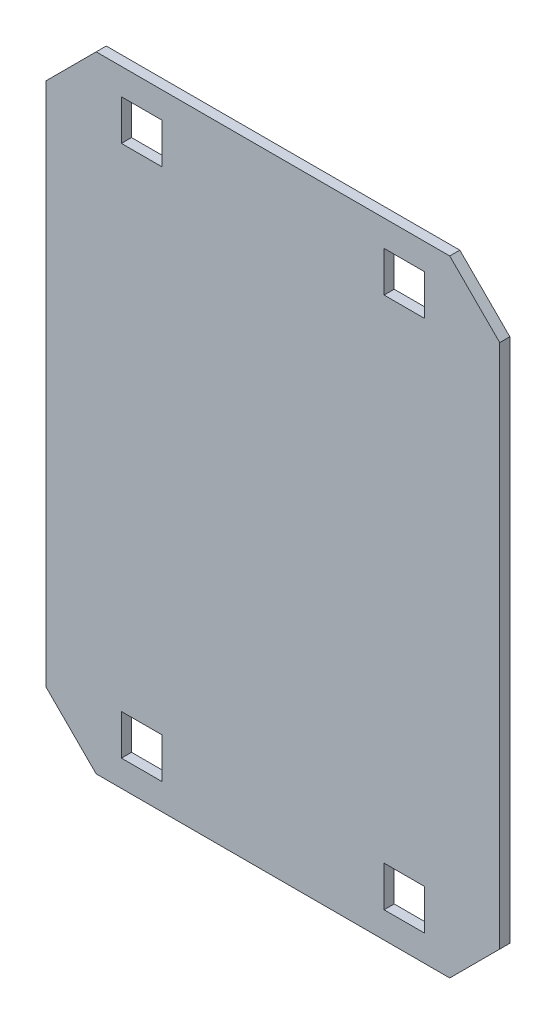
ISO-10303-21;
HEADER;
FILE_DESCRIPTION(('STEP AP214'),'2;1');
FILE_NAME('part.step','',(''),(''),'','','');
FILE_SCHEMA(('AUTOMOTIVE_DESIGN { 1 0 10303 214 1 1 1 1 }'));
ENDSEC;
DATA;
#1=APPLICATION_CONTEXT('core data for automotive mechanical design processes');
#2=APPLICATION_PROTOCOL_DEFINITION('international standard','automotive_design',2000,#1);
#3=PRODUCT_CONTEXT('',#1,'mechanical');
#4=PRODUCT('Part','Part','',(#3));
#5=PRODUCT_RELATED_PRODUCT_CATEGORY('part','',(#4));
#6=PRODUCT_DEFINITION_FORMATION('','',#4);
#7=PRODUCT_DEFINITION_CONTEXT('part definition',#1,'design');
#8=PRODUCT_DEFINITION('design','',#6,#7);
#9=PRODUCT_DEFINITION_SHAPE('','',#8);
#10=(LENGTH_UNIT() NAMED_UNIT(*) SI_UNIT(.MILLI.,.METRE.));
#11=(NAMED_UNIT(*) PLANE_ANGLE_UNIT() SI_UNIT($,.RADIAN.));
#12=(NAMED_UNIT(*) SI_UNIT($,.STERADIAN.) SOLID_ANGLE_UNIT());
#13=UNCERTAINTY_MEASURE_WITH_UNIT(LENGTH_MEASURE(1.E-05),#10,'distance_accuracy_value','');
#14=(GEOMETRIC_REPRESENTATION_CONTEXT(3) GLOBAL_UNCERTAINTY_ASSIGNED_CONTEXT((#13)) GLOBAL_UNIT_ASSIGNED_CONTEXT((#10,
#11,#12)) REPRESENTATION_CONTEXT('',''));
#15=CARTESIAN_POINT('',(0.,0.,0.));
#16=DIRECTION('',(0.,0.,1.));
#17=DIRECTION('',(1.,0.,0.));
#18=AXIS2_PLACEMENT_3D('',#15,#16,#17);
#19=CARTESIAN_POINT('',(-112.248737341529,130.,5.));
#20=DIRECTION('',(1.,0.,0.));
#21=DIRECTION('',(0.,1.,0.));
#22=AXIS2_PLACEMENT_3D('',#19,#20,#21);
#23=PLANE('',#22);
#24=DIRECTION('',(0.,-1.,0.));
#25=VECTOR('',#24,1.);
#26=CARTESIAN_POINT('',(-112.248737341529,130.,0.));
#27=LINE('',#26,#25);
#28=CARTESIAN_POINT('',(-112.248737341529,130.,0.));
#29=VERTEX_POINT('',#28);
#30=CARTESIAN_POINT('',(-112.248737341529,-130.,0.));
#31=VERTEX_POINT('',#30);
#32=EDGE_CURVE('E321',#29,#31,#27,.T.);
#33=ORIENTED_EDGE('',*,*,#32,.T.);
#34=DIRECTION('',(0.,0.,-1.));
#35=VECTOR('',#34,1.);
#36=CARTESIAN_POINT('',(-112.248737341529,-130.,5.));
#37=LINE('',#36,#35);
#38=CARTESIAN_POINT('',(-112.248737341529,-130.,5.));
#39=VERTEX_POINT('',#38);
#40=EDGE_CURVE('E11',#39,#31,#37,.T.);
#41=ORIENTED_EDGE('',*,*,#40,.F.);
#42=DIRECTION('',(0.,-1.,0.));
#43=VECTOR('',#42,1.);
#44=CARTESIAN_POINT('',(-112.248737341529,130.,5.));
#45=LINE('',#44,#43);
#46=CARTESIAN_POINT('',(-112.248737341529,130.,5.));
#47=VERTEX_POINT('',#46);
#48=EDGE_CURVE('E328',#47,#39,#45,.T.);
#49=ORIENTED_EDGE('',*,*,#48,.F.);
#50=DIRECTION('',(0.,0.,-1.));
#51=VECTOR('',#50,1.);
#52=CARTESIAN_POINT('',(-112.248737341529,130.,5.));
#53=LINE('',#52,#51);
#54=EDGE_CURVE('E346',#47,#29,#53,.T.);
#55=ORIENTED_EDGE('',*,*,#54,.T.);
#56=EDGE_LOOP('',(#33,#41,#49,#55));
#57=FACE_BOUND('',#56,.T.);
#58=ADVANCED_FACE('F32',(#57),#23,.F.);
#59=CARTESIAN_POINT('',(-112.248737341529,-130.,5.));
#60=DIRECTION('',(0.707106781186549,0.707106781186546,0.));
#61=DIRECTION('',(-0.707106781186546,0.707106781186549,0.));
#62=AXIS2_PLACEMENT_3D('',#59,#60,#61);
#63=PLANE('',#62);
#64=DIRECTION('',(0.707106781186546,-0.707106781186549,0.));
#65=VECTOR('',#64,1.);
#66=CARTESIAN_POINT('',(-112.248737341529,-130.,0.));
#67=LINE('',#66,#65);
#68=CARTESIAN_POINT('',(-87.5,-154.748737341529,0.));
#69=VERTEX_POINT('',#68);
#70=EDGE_CURVE('E349',#31,#69,#67,.T.);
#71=ORIENTED_EDGE('',*,*,#70,.T.);
#72=DIRECTION('',(0.,0.,-1.));
#73=VECTOR('',#72,1.);
#74=CARTESIAN_POINT('',(-87.5,-154.748737341529,5.));
#75=LINE('',#74,#73);
#76=CARTESIAN_POINT('',(-87.5,-154.748737341529,5.));
#77=VERTEX_POINT('',#76);
#78=EDGE_CURVE('E39',#77,#69,#75,.T.);
#79=ORIENTED_EDGE('',*,*,#78,.F.);
#80=DIRECTION('',(0.707106781186546,-0.707106781186549,0.));
#81=VECTOR('',#80,1.);
#82=CARTESIAN_POINT('',(-112.248737341529,-130.,5.));
#83=LINE('',#82,#81);
#84=EDGE_CURVE('E331',#39,#77,#83,.T.);
#85=ORIENTED_EDGE('',*,*,#84,.F.);
#86=ORIENTED_EDGE('',*,*,#40,.T.);
#87=EDGE_LOOP('',(#71,#79,#85,#86));
#88=FACE_BOUND('',#87,.T.);
#89=ADVANCED_FACE('F405',(#88),#63,.F.);
#90=CARTESIAN_POINT('',(87.5,-154.748737341529,5.));
#91=DIRECTION('',(0.,1.,0.));
#92=DIRECTION('',(-1.,0.,0.));
#93=AXIS2_PLACEMENT_3D('',#90,#91,#92);
#94=PLANE('',#93);
#95=DIRECTION('',(1.,0.,0.));
#96=VECTOR('',#95,1.);
#97=CARTESIAN_POINT('',(87.5,-154.748737341529,0.));
#98=LINE('',#97,#96);
#99=CARTESIAN_POINT('',(87.5,-154.748737341529,0.));
#100=VERTEX_POINT('',#99);
#101=EDGE_CURVE('E351',#69,#100,#98,.T.);
#102=ORIENTED_EDGE('',*,*,#101,.T.);
#103=DIRECTION('',(0.,0.,-1.));
#104=VECTOR('',#103,1.);
#105=CARTESIAN_POINT('',(87.5,-154.748737341529,5.));
#106=LINE('',#105,#104);
#107=CARTESIAN_POINT('',(87.5,-154.748737341529,5.));
#108=VERTEX_POINT('',#107);
#109=EDGE_CURVE('E376',#108,#100,#106,.T.);
#110=ORIENTED_EDGE('',*,*,#109,.F.);
#111=DIRECTION('',(1.,0.,0.));
#112=VECTOR('',#111,1.);
#113=CARTESIAN_POINT('',(87.5,-154.748737341529,5.));
#114=LINE('',#113,#112);
#115=EDGE_CURVE('E334',#77,#108,#114,.T.);
#116=ORIENTED_EDGE('',*,*,#115,.F.);
#117=ORIENTED_EDGE('',*,*,#78,.T.);
#118=EDGE_LOOP('',(#102,#110,#116,#117));
#119=FACE_BOUND('',#118,.T.);
#120=ADVANCED_FACE('F383',(#119),#94,.F.);
#121=CARTESIAN_POINT('',(112.248737341529,-130.,5.));
#122=DIRECTION('',(-0.707106781186549,0.707106781186546,0.));
#123=DIRECTION('',(-0.707106781186546,-0.707106781186549,0.));
#124=AXIS2_PLACEMENT_3D('',#121,#122,#123);
#125=PLANE('',#124);
#126=DIRECTION('',(0.707106781186546,0.707106781186549,0.));
#127=VECTOR('',#126,1.);
#128=CARTESIAN_POINT('',(112.248737341529,-130.,0.));
#129=LINE('',#128,#127);
#130=CARTESIAN_POINT('',(112.248737341529,-130.,0.));
#131=VERTEX_POINT('',#130);
#132=EDGE_CURVE('E353',#100,#131,#129,.T.);
#133=ORIENTED_EDGE('',*,*,#132,.T.);
#134=DIRECTION('',(0.,0.,-1.));
#135=VECTOR('',#134,1.);
#136=CARTESIAN_POINT('',(112.248737341529,-130.,5.));
#137=LINE('',#136,#135);
#138=CARTESIAN_POINT('',(112.248737341529,-130.,5.));
#139=VERTEX_POINT('',#138);
#140=EDGE_CURVE('E373',#139,#131,#137,.T.);
#141=ORIENTED_EDGE('',*,*,#140,.F.);
#142=DIRECTION('',(0.707106781186546,0.707106781186549,0.));
#143=VECTOR('',#142,1.);
#144=CARTESIAN_POINT('',(112.248737341529,-130.,5.));
#145=LINE('',#144,#143);
#146=EDGE_CURVE('E336',#108,#139,#145,.T.);
#147=ORIENTED_EDGE('',*,*,#146,.F.);
#148=ORIENTED_EDGE('',*,*,#109,.T.);
#149=EDGE_LOOP('',(#133,#141,#147,#148));
#150=FACE_BOUND('',#149,.T.);
#151=ADVANCED_FACE('F393',(#150),#125,.F.);
#152=CARTESIAN_POINT('',(112.248737341529,130.,5.));
#153=DIRECTION('',(-1.,0.,0.));
#154=DIRECTION('',(0.,0.,1.));
#155=AXIS2_PLACEMENT_3D('',#152,#153,#154);
#156=PLANE('',#155);
#157=DIRECTION('',(0.,1.,0.));
#158=VECTOR('',#157,1.);
#159=CARTESIAN_POINT('',(112.248737341529,130.,0.));
#160=LINE('',#159,#158);
#161=CARTESIAN_POINT('',(112.248737341529,130.,0.));
#162=VERTEX_POINT('',#161);
#163=EDGE_CURVE('E355',#131,#162,#160,.T.);
#164=ORIENTED_EDGE('',*,*,#163,.T.);
#165=DIRECTION('',(0.,0.,-1.));
#166=VECTOR('',#165,1.);
#167=CARTESIAN_POINT('',(112.248737341529,130.,5.));
#168=LINE('',#167,#166);
#169=CARTESIAN_POINT('',(112.248737341529,130.,5.));
#170=VERTEX_POINT('',#169);
#171=EDGE_CURVE('E370',#170,#162,#168,.T.);
#172=ORIENTED_EDGE('',*,*,#171,.F.);
#173=DIRECTION('',(0.,1.,0.));
#174=VECTOR('',#173,1.);
#175=CARTESIAN_POINT('',(112.248737341529,130.,5.));
#176=LINE('',#175,#174);
#177=EDGE_CURVE('E338',#139,#170,#176,.T.);
#178=ORIENTED_EDGE('',*,*,#177,.F.);
#179=ORIENTED_EDGE('',*,*,#140,.T.);
#180=EDGE_LOOP('',(#164,#172,#178,#179));
#181=FACE_BOUND('',#180,.T.);
#182=ADVANCED_FACE('F397',(#181),#156,.F.);
#183=CARTESIAN_POINT('',(112.248737341529,130.,5.));
#184=DIRECTION('',(-0.707106781186549,-0.707106781186546,0.));
#185=DIRECTION('',(0.707106781186546,-0.707106781186549,0.));
#186=AXIS2_PLACEMENT_3D('',#183,#184,#185);
#187=PLANE('',#186);
#188=DIRECTION('',(-0.707106781186546,0.707106781186549,0.));
#189=VECTOR('',#188,1.);
#190=CARTESIAN_POINT('',(112.248737341529,130.,0.));
#191=LINE('',#190,#189);
#192=CARTESIAN_POINT('',(87.5,154.748737341529,0.));
#193=VERTEX_POINT('',#192);
#194=EDGE_CURVE('E357',#162,#193,#191,.T.);
#195=ORIENTED_EDGE('',*,*,#194,.T.);
#196=DIRECTION('',(0.,0.,-1.));
#197=VECTOR('',#196,1.);
#198=CARTESIAN_POINT('',(87.5,154.748737341529,5.));
#199=LINE('',#198,#197);
#200=CARTESIAN_POINT('',(87.5,154.748737341529,5.));
#201=VERTEX_POINT('',#200);
#202=EDGE_CURVE('E367',#201,#193,#199,.T.);
#203=ORIENTED_EDGE('',*,*,#202,.F.);
#204=DIRECTION('',(-0.707106781186546,0.707106781186549,0.));
#205=VECTOR('',#204,1.);
#206=CARTESIAN_POINT('',(112.248737341529,130.,5.));
#207=LINE('',#206,#205);
#208=EDGE_CURVE('E340',#170,#201,#207,.T.);
#209=ORIENTED_EDGE('',*,*,#208,.F.);
#210=ORIENTED_EDGE('',*,*,#171,.T.);
#211=EDGE_LOOP('',(#195,#203,#209,#210));
#212=FACE_BOUND('',#211,.T.);
#213=ADVANCED_FACE('F418',(#212),#187,.F.);
#214=CARTESIAN_POINT('',(-87.5,154.748737341529,5.));
#215=DIRECTION('',(0.,-1.,0.));
#216=DIRECTION('',(1.,0.,0.));
#217=AXIS2_PLACEMENT_3D('',#214,#215,#216);
#218=PLANE('',#217);
#219=DIRECTION('',(-1.,0.,0.));
#220=VECTOR('',#219,1.);
#221=CARTESIAN_POINT('',(-87.5,154.748737341529,0.));
#222=LINE('',#221,#220);
#223=CARTESIAN_POINT('',(-87.5,154.748737341529,0.));
#224=VERTEX_POINT('',#223);
#225=EDGE_CURVE('E359',#193,#224,#222,.T.);
#226=ORIENTED_EDGE('',*,*,#225,.T.);
#227=DIRECTION('',(0.,0.,-1.));
#228=VECTOR('',#227,1.);
#229=CARTESIAN_POINT('',(-87.5,154.748737341529,5.));
#230=LINE('',#229,#228);
#231=CARTESIAN_POINT('',(-87.5,154.748737341529,5.));
#232=VERTEX_POINT('',#231);
#233=EDGE_CURVE('E364',#232,#224,#230,.T.);
#234=ORIENTED_EDGE('',*,*,#233,.F.);
#235=DIRECTION('',(-1.,0.,0.));
#236=VECTOR('',#235,1.);
#237=CARTESIAN_POINT('',(-87.5,154.748737341529,5.));
#238=LINE('',#237,#236);
#239=EDGE_CURVE('E342',#201,#232,#238,.T.);
#240=ORIENTED_EDGE('',*,*,#239,.F.);
#241=ORIENTED_EDGE('',*,*,#202,.T.);
#242=EDGE_LOOP('',(#226,#234,#240,#241));
#243=FACE_BOUND('',#242,.T.);
#244=ADVANCED_FACE('F416',(#243),#218,.F.);
#245=CARTESIAN_POINT('',(-112.248737341529,130.,5.));
#246=DIRECTION('',(0.707106781186549,-0.707106781186546,0.));
#247=DIRECTION('',(0.707106781186546,0.707106781186549,0.));
#248=AXIS2_PLACEMENT_3D('',#245,#246,#247);
#249=PLANE('',#248);
#250=DIRECTION('',(-0.707106781186546,-0.707106781186549,0.));
#251=VECTOR('',#250,1.);
#252=CARTESIAN_POINT('',(-112.248737341529,130.,0.));
#253=LINE('',#252,#251);
#254=EDGE_CURVE('E332',#224,#29,#253,.T.);
#255=ORIENTED_EDGE('',*,*,#254,.T.);
#256=ORIENTED_EDGE('',*,*,#54,.F.);
#257=DIRECTION('',(-0.707106781186546,-0.707106781186549,0.));
#258=VECTOR('',#257,1.);
#259=CARTESIAN_POINT('',(-112.248737341529,130.,5.));
#260=LINE('',#259,#258);
#261=EDGE_CURVE('E344',#232,#47,#260,.T.);
#262=ORIENTED_EDGE('',*,*,#261,.F.);
#263=ORIENTED_EDGE('',*,*,#233,.T.);
#264=EDGE_LOOP('',(#255,#256,#262,#263));
#265=FACE_BOUND('',#264,.T.);
#266=ADVANCED_FACE('F411',(#265),#249,.F.);
#267=CARTESIAN_POINT('',(0.,0.,5.));
#268=DIRECTION('',(0.,0.,-1.));
#269=DIRECTION('',(-1.,0.,0.));
#270=AXIS2_PLACEMENT_3D('',#267,#268,#269);
#271=PLANE('',#270);
#272=DIRECTION('',(-1.,0.,0.));
#273=VECTOR('',#272,1.);
#274=CARTESIAN_POINT('',(75.0000000000001,141.748737341529,5.));
#275=LINE('',#274,#273);
#276=CARTESIAN_POINT('',(75.0000000000001,141.748737341529,5.));
#277=VERTEX_POINT('',#276);
#278=CARTESIAN_POINT('',(55.0000000000001,141.748737341529,5.));
#279=VERTEX_POINT('',#278);
#280=EDGE_CURVE('E282',#277,#279,#275,.T.);
#281=ORIENTED_EDGE('',*,*,#280,.F.);
#282=DIRECTION('',(0.,1.,0.));
#283=VECTOR('',#282,1.);
#284=CARTESIAN_POINT('',(75.0000000000001,141.748737341529,5.));
#285=LINE('',#284,#283);
#286=CARTESIAN_POINT('',(75.0000000000001,121.748737341529,5.));
#287=VERTEX_POINT('',#286);
#288=EDGE_CURVE('E46',#287,#277,#285,.T.);
#289=ORIENTED_EDGE('',*,*,#288,.F.);
#290=DIRECTION('',(1.,0.,0.));
#291=VECTOR('',#290,1.);
#292=CARTESIAN_POINT('',(75.0000000000001,121.748737341529,5.));
#293=LINE('',#292,#291);
#294=CARTESIAN_POINT('',(55.0000000000001,121.748737341529,5.));
#295=VERTEX_POINT('',#294);
#296=EDGE_CURVE('E271',#295,#287,#293,.T.);
#297=ORIENTED_EDGE('',*,*,#296,.F.);
#298=DIRECTION('',(0.,-1.,0.));
#299=VECTOR('',#298,1.);
#300=CARTESIAN_POINT('',(55.0000000000001,141.748737341529,5.));
#301=LINE('',#300,#299);
#302=EDGE_CURVE('E285',#279,#295,#301,.T.);
#303=ORIENTED_EDGE('',*,*,#302,.F.);
#304=EDGE_LOOP('',(#281,#289,#297,#303));
#305=FACE_BOUND('',#304,.T.);
#306=DIRECTION('',(-1.,0.,0.));
#307=VECTOR('',#306,1.);
#308=CARTESIAN_POINT('',(75.,-121.748737341529,5.));
#309=LINE('',#308,#307);
#310=CARTESIAN_POINT('',(75.,-121.748737341529,5.));
#311=VERTEX_POINT('',#310);
#312=CARTESIAN_POINT('',(55.,-121.748737341529,5.));
#313=VERTEX_POINT('',#312);
#314=EDGE_CURVE('E252',#311,#313,#309,.T.);
#315=ORIENTED_EDGE('',*,*,#314,.F.);
#316=DIRECTION('',(0.,1.,0.));
#317=VECTOR('',#316,1.);
#318=CARTESIAN_POINT('',(75.,-141.748737341529,5.));
#319=LINE('',#318,#317);
#320=CARTESIAN_POINT('',(75.,-141.748737341529,5.));
#321=VERTEX_POINT('',#320);
#322=EDGE_CURVE('E54',#321,#311,#319,.T.);
#323=ORIENTED_EDGE('',*,*,#322,.F.);
#324=DIRECTION('',(1.,0.,0.));
#325=VECTOR('',#324,1.);
#326=CARTESIAN_POINT('',(75.,-141.748737341529,5.));
#327=LINE('',#326,#325);
#328=CARTESIAN_POINT('',(55.,-141.748737341529,5.));
#329=VERTEX_POINT('',#328);
#330=EDGE_CURVE('E241',#329,#321,#327,.T.);
#331=ORIENTED_EDGE('',*,*,#330,.F.);
#332=DIRECTION('',(0.,-1.,0.));
#333=VECTOR('',#332,1.);
#334=CARTESIAN_POINT('',(55.,-141.748737341529,5.));
#335=LINE('',#334,#333);
#336=EDGE_CURVE('E256',#313,#329,#335,.T.);
#337=ORIENTED_EDGE('',*,*,#336,.F.);
#338=EDGE_LOOP('',(#315,#323,#331,#337));
#339=FACE_BOUND('',#338,.T.);
#340=DIRECTION('',(1.,0.,0.));
#341=VECTOR('',#340,1.);
#342=CARTESIAN_POINT('',(-74.9999999999999,-141.748737341529,5.));
#343=LINE('',#342,#341);
#344=CARTESIAN_POINT('',(-74.9999999999999,-141.748737341529,5.));
#345=VERTEX_POINT('',#344);
#346=CARTESIAN_POINT('',(-54.9999999999999,-141.748737341529,5.));
#347=VERTEX_POINT('',#346);
#348=EDGE_CURVE('E226',#345,#347,#343,.T.);
#349=ORIENTED_EDGE('',*,*,#348,.F.);
#350=DIRECTION('',(0.,-1.,0.));
#351=VECTOR('',#350,1.);
#352=CARTESIAN_POINT('',(-74.9999999999999,-141.748737341529,5.));
#353=LINE('',#352,#351);
#354=CARTESIAN_POINT('',(-75.,-121.748737341529,5.));
#355=VERTEX_POINT('',#354);
#356=EDGE_CURVE('E199',#355,#345,#353,.T.);
#357=ORIENTED_EDGE('',*,*,#356,.F.);
#358=DIRECTION('',(-1.,0.,0.));
#359=VECTOR('',#358,1.);
#360=CARTESIAN_POINT('',(-75.,-121.748737341529,5.));
#361=LINE('',#360,#359);
#362=CARTESIAN_POINT('',(-55.,-121.748737341529,5.));
#363=VERTEX_POINT('',#362);
#364=EDGE_CURVE('E217',#363,#355,#361,.T.);
#365=ORIENTED_EDGE('',*,*,#364,.F.);
#366=DIRECTION('',(0.,1.,0.));
#367=VECTOR('',#366,1.);
#368=CARTESIAN_POINT('',(-54.9999999999999,-141.748737341529,5.));
#369=LINE('',#368,#367);
#370=EDGE_CURVE('E220',#347,#363,#369,.T.);
#371=ORIENTED_EDGE('',*,*,#370,.F.);
#372=EDGE_LOOP('',(#349,#357,#365,#371));
#373=FACE_BOUND('',#372,.T.);
#374=DIRECTION('',(-1.,0.,0.));
#375=VECTOR('',#374,1.);
#376=CARTESIAN_POINT('',(-75.,141.748737341529,5.));
#377=LINE('',#376,#375);
#378=CARTESIAN_POINT('',(-55.,141.748737341529,5.));
#379=VERTEX_POINT('',#378);
#380=CARTESIAN_POINT('',(-75.,141.748737341529,5.));
#381=VERTEX_POINT('',#380);
#382=EDGE_CURVE('E311',#379,#381,#377,.T.);
#383=ORIENTED_EDGE('',*,*,#382,.F.);
#384=DIRECTION('',(0.,1.,0.));
#385=VECTOR('',#384,1.);
#386=CARTESIAN_POINT('',(-55.,141.748737341529,5.));
#387=LINE('',#386,#385);
#388=CARTESIAN_POINT('',(-55.,121.748737341529,5.));
#389=VERTEX_POINT('',#388);
#390=EDGE_CURVE('E233',#389,#379,#387,.T.);
#391=ORIENTED_EDGE('',*,*,#390,.F.);
#392=DIRECTION('',(1.,0.,0.));
#393=VECTOR('',#392,1.);
#394=CARTESIAN_POINT('',(-75.,121.748737341529,5.));
#395=LINE('',#394,#393);
#396=CARTESIAN_POINT('',(-75.,121.748737341529,5.));
#397=VERTEX_POINT('',#396);
#398=EDGE_CURVE('E300',#397,#389,#395,.T.);
#399=ORIENTED_EDGE('',*,*,#398,.F.);
#400=DIRECTION('',(0.,-1.,0.));
#401=VECTOR('',#400,1.);
#402=CARTESIAN_POINT('',(-75.,141.748737341529,5.));
#403=LINE('',#402,#401);
#404=EDGE_CURVE('E314',#381,#397,#403,.T.);
#405=ORIENTED_EDGE('',*,*,#404,.F.);
#406=EDGE_LOOP('',(#383,#391,#399,#405));
#407=FACE_BOUND('',#406,.T.);
#408=ORIENTED_EDGE('',*,*,#48,.T.);
#409=ORIENTED_EDGE('',*,*,#84,.T.);
#410=ORIENTED_EDGE('',*,*,#115,.T.);
#411=ORIENTED_EDGE('',*,*,#146,.T.);
#412=ORIENTED_EDGE('',*,*,#177,.T.);
#413=ORIENTED_EDGE('',*,*,#208,.T.);
#414=ORIENTED_EDGE('',*,*,#239,.T.);
#415=ORIENTED_EDGE('',*,*,#261,.T.);
#416=EDGE_LOOP('',(#408,#409,#410,#411,#412,#413,#414,#415));
#417=FACE_BOUND('',#416,.T.);
#418=ADVANCED_FACE('F401',(#305,#339,#373,#407,#417),#271,.F.);
#419=CARTESIAN_POINT('',(0.,0.,0.));
#420=DIRECTION('',(0.,0.,-1.));
#421=DIRECTION('',(-1.,0.,0.));
#422=AXIS2_PLACEMENT_3D('',#419,#420,#421);
#423=PLANE('',#422);
#424=DIRECTION('',(0.,1.,0.));
#425=VECTOR('',#424,1.);
#426=CARTESIAN_POINT('',(75.0000000000001,141.748737341529,0.));
#427=LINE('',#426,#425);
#428=CARTESIAN_POINT('',(75.0000000000001,121.748737341529,0.));
#429=VERTEX_POINT('',#428);
#430=CARTESIAN_POINT('',(75.0000000000001,141.748737341529,0.));
#431=VERTEX_POINT('',#430);
#432=EDGE_CURVE('E267',#429,#431,#427,.T.);
#433=ORIENTED_EDGE('',*,*,#432,.T.);
#434=DIRECTION('',(-1.,0.,0.));
#435=VECTOR('',#434,1.);
#436=CARTESIAN_POINT('',(75.0000000000001,141.748737341529,0.));
#437=LINE('',#436,#435);
#438=CARTESIAN_POINT('',(55.0000000000001,141.748737341529,0.));
#439=VERTEX_POINT('',#438);
#440=EDGE_CURVE('E270',#431,#439,#437,.T.);
#441=ORIENTED_EDGE('',*,*,#440,.T.);
#442=DIRECTION('',(0.,-1.,0.));
#443=VECTOR('',#442,1.);
#444=CARTESIAN_POINT('',(55.0000000000001,141.748737341529,0.));
#445=LINE('',#444,#443);
#446=CARTESIAN_POINT('',(55.0000000000001,121.748737341529,0.));
#447=VERTEX_POINT('',#446);
#448=EDGE_CURVE('E274',#439,#447,#445,.T.);
#449=ORIENTED_EDGE('',*,*,#448,.T.);
#450=DIRECTION('',(1.,0.,0.));
#451=VECTOR('',#450,1.);
#452=CARTESIAN_POINT('',(75.0000000000001,121.748737341529,0.));
#453=LINE('',#452,#451);
#454=EDGE_CURVE('E277',#447,#429,#453,.T.);
#455=ORIENTED_EDGE('',*,*,#454,.T.);
#456=EDGE_LOOP('',(#433,#441,#449,#455));
#457=FACE_BOUND('',#456,.T.);
#458=DIRECTION('',(0.,1.,0.));
#459=VECTOR('',#458,1.);
#460=CARTESIAN_POINT('',(75.,-141.748737341529,0.));
#461=LINE('',#460,#459);
#462=CARTESIAN_POINT('',(75.,-141.748737341529,0.));
#463=VERTEX_POINT('',#462);
#464=CARTESIAN_POINT('',(75.,-121.748737341529,0.));
#465=VERTEX_POINT('',#464);
#466=EDGE_CURVE('E237',#463,#465,#461,.T.);
#467=ORIENTED_EDGE('',*,*,#466,.T.);
#468=DIRECTION('',(-1.,0.,0.));
#469=VECTOR('',#468,1.);
#470=CARTESIAN_POINT('',(75.,-121.748737341529,0.));
#471=LINE('',#470,#469);
#472=CARTESIAN_POINT('',(55.,-121.748737341529,0.));
#473=VERTEX_POINT('',#472);
#474=EDGE_CURVE('E240',#465,#473,#471,.T.);
#475=ORIENTED_EDGE('',*,*,#474,.T.);
#476=DIRECTION('',(0.,-1.,0.));
#477=VECTOR('',#476,1.);
#478=CARTESIAN_POINT('',(55.,-141.748737341529,0.));
#479=LINE('',#478,#477);
#480=CARTESIAN_POINT('',(55.,-141.748737341529,0.));
#481=VERTEX_POINT('',#480);
#482=EDGE_CURVE('E244',#473,#481,#479,.T.);
#483=ORIENTED_EDGE('',*,*,#482,.T.);
#484=DIRECTION('',(1.,0.,0.));
#485=VECTOR('',#484,1.);
#486=CARTESIAN_POINT('',(75.,-141.748737341529,0.));
#487=LINE('',#486,#485);
#488=EDGE_CURVE('E247',#481,#463,#487,.T.);
#489=ORIENTED_EDGE('',*,*,#488,.T.);
#490=EDGE_LOOP('',(#467,#475,#483,#489));
#491=FACE_BOUND('',#490,.T.);
#492=DIRECTION('',(0.,-1.,0.));
#493=VECTOR('',#492,1.);
#494=CARTESIAN_POINT('',(-74.9999999999999,-141.748737341529,0.));
#495=LINE('',#494,#493);
#496=CARTESIAN_POINT('',(-75.,-121.748737341529,0.));
#497=VERTEX_POINT('',#496);
#498=CARTESIAN_POINT('',(-74.9999999999999,-141.748737341529,0.));
#499=VERTEX_POINT('',#498);
#500=EDGE_CURVE('E196',#497,#499,#495,.T.);
#501=ORIENTED_EDGE('',*,*,#500,.T.);
#502=DIRECTION('',(1.,0.,0.));
#503=VECTOR('',#502,1.);
#504=CARTESIAN_POINT('',(-74.9999999999999,-141.748737341529,0.));
#505=LINE('',#504,#503);
#506=CARTESIAN_POINT('',(-54.9999999999999,-141.748737341529,0.));
#507=VERTEX_POINT('',#506);
#508=EDGE_CURVE('E208',#499,#507,#505,.T.);
#509=ORIENTED_EDGE('',*,*,#508,.T.);
#510=DIRECTION('',(0.,1.,0.));
#511=VECTOR('',#510,1.);
#512=CARTESIAN_POINT('',(-54.9999999999999,-141.748737341529,0.));
#513=LINE('',#512,#511);
#514=CARTESIAN_POINT('',(-55.,-121.748737341529,0.));
#515=VERTEX_POINT('',#514);
#516=EDGE_CURVE('E212',#507,#515,#513,.T.);
#517=ORIENTED_EDGE('',*,*,#516,.T.);
#518=DIRECTION('',(-1.,0.,0.));
#519=VECTOR('',#518,1.);
#520=CARTESIAN_POINT('',(-75.,-121.748737341529,0.));
#521=LINE('',#520,#519);
#522=EDGE_CURVE('E204',#515,#497,#521,.T.);
#523=ORIENTED_EDGE('',*,*,#522,.T.);
#524=EDGE_LOOP('',(#501,#509,#517,#523));
#525=FACE_BOUND('',#524,.T.);
#526=DIRECTION('',(0.,1.,0.));
#527=VECTOR('',#526,1.);
#528=CARTESIAN_POINT('',(-55.,141.748737341529,0.));
#529=LINE('',#528,#527);
#530=CARTESIAN_POINT('',(-55.,121.748737341529,0.));
#531=VERTEX_POINT('',#530);
#532=CARTESIAN_POINT('',(-55.,141.748737341529,0.));
#533=VERTEX_POINT('',#532);
#534=EDGE_CURVE('E296',#531,#533,#529,.T.);
#535=ORIENTED_EDGE('',*,*,#534,.T.);
#536=DIRECTION('',(-1.,0.,0.));
#537=VECTOR('',#536,1.);
#538=CARTESIAN_POINT('',(-75.,141.748737341529,0.));
#539=LINE('',#538,#537);
#540=CARTESIAN_POINT('',(-75.,141.748737341529,0.));
#541=VERTEX_POINT('',#540);
#542=EDGE_CURVE('E299',#533,#541,#539,.T.);
#543=ORIENTED_EDGE('',*,*,#542,.T.);
#544=DIRECTION('',(0.,-1.,0.));
#545=VECTOR('',#544,1.);
#546=CARTESIAN_POINT('',(-75.,141.748737341529,0.));
#547=LINE('',#546,#545);
#548=CARTESIAN_POINT('',(-75.,121.748737341529,0.));
#549=VERTEX_POINT('',#548);
#550=EDGE_CURVE('E303',#541,#549,#547,.T.);
#551=ORIENTED_EDGE('',*,*,#550,.T.);
#552=DIRECTION('',(1.,0.,0.));
#553=VECTOR('',#552,1.);
#554=CARTESIAN_POINT('',(-75.,121.748737341529,0.));
#555=LINE('',#554,#553);
#556=EDGE_CURVE('E306',#549,#531,#555,.T.);
#557=ORIENTED_EDGE('',*,*,#556,.T.);
#558=EDGE_LOOP('',(#535,#543,#551,#557));
#559=FACE_BOUND('',#558,.T.);
#560=ORIENTED_EDGE('',*,*,#32,.F.);
#561=ORIENTED_EDGE('',*,*,#254,.F.);
#562=ORIENTED_EDGE('',*,*,#225,.F.);
#563=ORIENTED_EDGE('',*,*,#194,.F.);
#564=ORIENTED_EDGE('',*,*,#163,.F.);
#565=ORIENTED_EDGE('',*,*,#132,.F.);
#566=ORIENTED_EDGE('',*,*,#101,.F.);
#567=ORIENTED_EDGE('',*,*,#70,.F.);
#568=EDGE_LOOP('',(#560,#561,#562,#563,#564,#565,#566,#567));
#569=FACE_BOUND('',#568,.T.);
#570=ADVANCED_FACE('F214',(#457,#491,#525,#559,#569),#423,.T.);
#571=CARTESIAN_POINT('',(-55.,141.748737341529,0.));
#572=DIRECTION('',(1.,0.,0.));
#573=DIRECTION('',(0.,0.,-1.));
#574=AXIS2_PLACEMENT_3D('',#571,#572,#573);
#575=PLANE('',#574);
#576=ORIENTED_EDGE('',*,*,#390,.T.);
#577=DIRECTION('',(0.,0.,1.));
#578=VECTOR('',#577,1.);
#579=CARTESIAN_POINT('',(-55.,141.748737341529,0.));
#580=LINE('',#579,#578);
#581=EDGE_CURVE('E309',#533,#379,#580,.T.);
#582=ORIENTED_EDGE('',*,*,#581,.F.);
#583=ORIENTED_EDGE('',*,*,#534,.F.);
#584=DIRECTION('',(0.,0.,1.));
#585=VECTOR('',#584,1.);
#586=CARTESIAN_POINT('',(-55.,121.748737341529,0.));
#587=LINE('',#586,#585);
#588=EDGE_CURVE('E319',#531,#389,#587,.T.);
#589=ORIENTED_EDGE('',*,*,#588,.T.);
#590=EDGE_LOOP('',(#576,#582,#583,#589));
#591=FACE_BOUND('',#590,.T.);
#592=ADVANCED_FACE('F481',(#591),#575,.F.);
#593=CARTESIAN_POINT('',(-75.,121.748737341529,0.));
#594=DIRECTION('',(0.,-1.,0.));
#595=DIRECTION('',(0.,0.,-1.));
#596=AXIS2_PLACEMENT_3D('',#593,#594,#595);
#597=PLANE('',#596);
#598=ORIENTED_EDGE('',*,*,#398,.T.);
#599=ORIENTED_EDGE('',*,*,#588,.F.);
#600=ORIENTED_EDGE('',*,*,#556,.F.);
#601=DIRECTION('',(0.,0.,1.));
#602=VECTOR('',#601,1.);
#603=CARTESIAN_POINT('',(-75.,121.748737341529,0.));
#604=LINE('',#603,#602);
#605=EDGE_CURVE('E322',#549,#397,#604,.T.);
#606=ORIENTED_EDGE('',*,*,#605,.T.);
#607=EDGE_LOOP('',(#598,#599,#600,#606));
#608=FACE_BOUND('',#607,.T.);
#609=ADVANCED_FACE('F491',(#608),#597,.F.);
#610=CARTESIAN_POINT('',(-75.,141.748737341529,0.));
#611=DIRECTION('',(-1.,0.,0.));
#612=DIRECTION('',(0.,0.,1.));
#613=AXIS2_PLACEMENT_3D('',#610,#611,#612);
#614=PLANE('',#613);
#615=ORIENTED_EDGE('',*,*,#404,.T.);
#616=ORIENTED_EDGE('',*,*,#605,.F.);
#617=ORIENTED_EDGE('',*,*,#550,.F.);
#618=DIRECTION('',(0.,0.,1.));
#619=VECTOR('',#618,1.);
#620=CARTESIAN_POINT('',(-75.,141.748737341529,0.));
#621=LINE('',#620,#619);
#622=EDGE_CURVE('E324',#541,#381,#621,.T.);
#623=ORIENTED_EDGE('',*,*,#622,.T.);
#624=EDGE_LOOP('',(#615,#616,#617,#623));
#625=FACE_BOUND('',#624,.T.);
#626=ADVANCED_FACE('F501',(#625),#614,.F.);
#627=CARTESIAN_POINT('',(-75.,141.748737341529,0.));
#628=DIRECTION('',(0.,1.,0.));
#629=DIRECTION('',(0.,0.,1.));
#630=AXIS2_PLACEMENT_3D('',#627,#628,#629);
#631=PLANE('',#630);
#632=ORIENTED_EDGE('',*,*,#382,.T.);
#633=ORIENTED_EDGE('',*,*,#622,.F.);
#634=ORIENTED_EDGE('',*,*,#542,.F.);
#635=ORIENTED_EDGE('',*,*,#581,.T.);
#636=EDGE_LOOP('',(#632,#633,#634,#635));
#637=FACE_BOUND('',#636,.T.);
#638=ADVANCED_FACE('F511',(#637),#631,.F.);
#639=CARTESIAN_POINT('',(-74.9999999999999,-141.748737341529,0.));
#640=DIRECTION('',(-1.,0.,0.));
#641=DIRECTION('',(0.,-1.,0.));
#642=AXIS2_PLACEMENT_3D('',#639,#640,#641);
#643=PLANE('',#642);
#644=ORIENTED_EDGE('',*,*,#356,.T.);
#645=DIRECTION('',(0.,0.,1.));
#646=VECTOR('',#645,1.);
#647=CARTESIAN_POINT('',(-74.9999999999999,-141.748737341529,0.));
#648=LINE('',#647,#646);
#649=EDGE_CURVE('E192',#499,#345,#648,.T.);
#650=ORIENTED_EDGE('',*,*,#649,.F.);
#651=ORIENTED_EDGE('',*,*,#500,.F.);
#652=DIRECTION('',(0.,0.,1.));
#653=VECTOR('',#652,1.);
#654=CARTESIAN_POINT('',(-75.,-121.748737341529,0.));
#655=LINE('',#654,#653);
#656=EDGE_CURVE('E231',#497,#355,#655,.T.);
#657=ORIENTED_EDGE('',*,*,#656,.T.);
#658=EDGE_LOOP('',(#644,#650,#651,#657));
#659=FACE_BOUND('',#658,.T.);
#660=ADVANCED_FACE('F194',(#659),#643,.F.);
#661=CARTESIAN_POINT('',(-75.,-121.748737341529,0.));
#662=DIRECTION('',(0.,1.,0.));
#663=DIRECTION('',(-1.,0.,0.));
#664=AXIS2_PLACEMENT_3D('',#661,#662,#663);
#665=PLANE('',#664);
#666=ORIENTED_EDGE('',*,*,#364,.T.);
#667=ORIENTED_EDGE('',*,*,#656,.F.);
#668=ORIENTED_EDGE('',*,*,#522,.F.);
#669=DIRECTION('',(0.,0.,1.));
#670=VECTOR('',#669,1.);
#671=CARTESIAN_POINT('',(-55.,-121.748737341529,0.));
#672=LINE('',#671,#670);
#673=EDGE_CURVE('E234',#515,#363,#672,.T.);
#674=ORIENTED_EDGE('',*,*,#673,.T.);
#675=EDGE_LOOP('',(#666,#667,#668,#674));
#676=FACE_BOUND('',#675,.T.);
#677=ADVANCED_FACE('F530',(#676),#665,.F.);
#678=CARTESIAN_POINT('',(-54.9999999999999,-141.748737341529,0.));
#679=DIRECTION('',(1.,0.,0.));
#680=DIRECTION('',(0.,1.,0.));
#681=AXIS2_PLACEMENT_3D('',#678,#679,#680);
#682=PLANE('',#681);
#683=ORIENTED_EDGE('',*,*,#370,.T.);
#684=ORIENTED_EDGE('',*,*,#673,.F.);
#685=ORIENTED_EDGE('',*,*,#516,.F.);
#686=DIRECTION('',(0.,0.,1.));
#687=VECTOR('',#686,1.);
#688=CARTESIAN_POINT('',(-54.9999999999999,-141.748737341529,0.));
#689=LINE('',#688,#687);
#690=EDGE_CURVE('E203',#507,#347,#689,.T.);
#691=ORIENTED_EDGE('',*,*,#690,.T.);
#692=EDGE_LOOP('',(#683,#684,#685,#691));
#693=FACE_BOUND('',#692,.T.);
#694=ADVANCED_FACE('F539',(#693),#682,.F.);
#695=CARTESIAN_POINT('',(-74.9999999999999,-141.748737341529,0.));
#696=DIRECTION('',(0.,-1.,0.));
#697=DIRECTION('',(0.,0.,-1.));
#698=AXIS2_PLACEMENT_3D('',#695,#696,#697);
#699=PLANE('',#698);
#700=ORIENTED_EDGE('',*,*,#348,.T.);
#701=ORIENTED_EDGE('',*,*,#690,.F.);
#702=ORIENTED_EDGE('',*,*,#508,.F.);
#703=ORIENTED_EDGE('',*,*,#649,.T.);
#704=EDGE_LOOP('',(#700,#701,#702,#703));
#705=FACE_BOUND('',#704,.T.);
#706=ADVANCED_FACE('F209',(#705),#699,.F.);
#707=CARTESIAN_POINT('',(75.,-141.748737341529,0.));
#708=DIRECTION('',(1.,0.,0.));
#709=DIRECTION('',(0.,1.,0.));
#710=AXIS2_PLACEMENT_3D('',#707,#708,#709);
#711=PLANE('',#710);
#712=ORIENTED_EDGE('',*,*,#322,.T.);
#713=DIRECTION('',(0.,0.,1.));
#714=VECTOR('',#713,1.);
#715=CARTESIAN_POINT('',(75.,-121.748737341529,0.));
#716=LINE('',#715,#714);
#717=EDGE_CURVE('E250',#465,#311,#716,.T.);
#718=ORIENTED_EDGE('',*,*,#717,.F.);
#719=ORIENTED_EDGE('',*,*,#466,.F.);
#720=DIRECTION('',(0.,0.,1.));
#721=VECTOR('',#720,1.);
#722=CARTESIAN_POINT('',(75.,-141.748737341529,0.));
#723=LINE('',#722,#721);
#724=EDGE_CURVE('E227',#463,#321,#723,.T.);
#725=ORIENTED_EDGE('',*,*,#724,.T.);
#726=EDGE_LOOP('',(#712,#718,#719,#725));
#727=FACE_BOUND('',#726,.T.);
#728=ADVANCED_FACE('F558',(#727),#711,.F.);
#729=CARTESIAN_POINT('',(75.,-141.748737341529,0.));
#730=DIRECTION('',(0.,-1.,0.));
#731=DIRECTION('',(0.,0.,-1.));
#732=AXIS2_PLACEMENT_3D('',#729,#730,#731);
#733=PLANE('',#732);
#734=ORIENTED_EDGE('',*,*,#330,.T.);
#735=ORIENTED_EDGE('',*,*,#724,.F.);
#736=ORIENTED_EDGE('',*,*,#488,.F.);
#737=DIRECTION('',(0.,0.,1.));
#738=VECTOR('',#737,1.);
#739=CARTESIAN_POINT('',(55.,-141.748737341529,0.));
#740=LINE('',#739,#738);
#741=EDGE_CURVE('E262',#481,#329,#740,.T.);
#742=ORIENTED_EDGE('',*,*,#741,.T.);
#743=EDGE_LOOP('',(#734,#735,#736,#742));
#744=FACE_BOUND('',#743,.T.);
#745=ADVANCED_FACE('F567',(#744),#733,.F.);
#746=CARTESIAN_POINT('',(55.,-141.748737341529,0.));
#747=DIRECTION('',(-1.,0.,0.));
#748=DIRECTION('',(0.,-1.,0.));
#749=AXIS2_PLACEMENT_3D('',#746,#747,#748);
#750=PLANE('',#749);
#751=ORIENTED_EDGE('',*,*,#336,.T.);
#752=ORIENTED_EDGE('',*,*,#741,.F.);
#753=ORIENTED_EDGE('',*,*,#482,.F.);
#754=DIRECTION('',(0.,0.,1.));
#755=VECTOR('',#754,1.);
#756=CARTESIAN_POINT('',(55.,-121.748737341529,0.));
#757=LINE('',#756,#755);
#758=EDGE_CURVE('E264',#473,#313,#757,.T.);
#759=ORIENTED_EDGE('',*,*,#758,.T.);
#760=EDGE_LOOP('',(#751,#752,#753,#759));
#761=FACE_BOUND('',#760,.T.);
#762=ADVANCED_FACE('F576',(#761),#750,.F.);
#763=CARTESIAN_POINT('',(75.,-121.748737341529,0.));
#764=DIRECTION('',(0.,1.,0.));
#765=DIRECTION('',(-1.,0.,0.));
#766=AXIS2_PLACEMENT_3D('',#763,#764,#765);
#767=PLANE('',#766);
#768=ORIENTED_EDGE('',*,*,#314,.T.);
#769=ORIENTED_EDGE('',*,*,#758,.F.);
#770=ORIENTED_EDGE('',*,*,#474,.F.);
#771=ORIENTED_EDGE('',*,*,#717,.T.);
#772=EDGE_LOOP('',(#768,#769,#770,#771));
#773=FACE_BOUND('',#772,.T.);
#774=ADVANCED_FACE('F586',(#773),#767,.F.);
#775=CARTESIAN_POINT('',(75.0000000000001,141.748737341529,0.));
#776=DIRECTION('',(1.,0.,0.));
#777=DIRECTION('',(0.,0.,-1.));
#778=AXIS2_PLACEMENT_3D('',#775,#776,#777);
#779=PLANE('',#778);
#780=ORIENTED_EDGE('',*,*,#288,.T.);
#781=DIRECTION('',(0.,0.,1.));
#782=VECTOR('',#781,1.);
#783=CARTESIAN_POINT('',(75.0000000000001,141.748737341529,0.));
#784=LINE('',#783,#782);
#785=EDGE_CURVE('E280',#431,#277,#784,.T.);
#786=ORIENTED_EDGE('',*,*,#785,.F.);
#787=ORIENTED_EDGE('',*,*,#432,.F.);
#788=DIRECTION('',(0.,0.,1.));
#789=VECTOR('',#788,1.);
#790=CARTESIAN_POINT('',(75.0000000000001,121.748737341529,0.));
#791=LINE('',#790,#789);
#792=EDGE_CURVE('E253',#429,#287,#791,.T.);
#793=ORIENTED_EDGE('',*,*,#792,.T.);
#794=EDGE_LOOP('',(#780,#786,#787,#793));
#795=FACE_BOUND('',#794,.T.);
#796=ADVANCED_FACE('F596',(#795),#779,.F.);
#797=CARTESIAN_POINT('',(75.0000000000001,121.748737341529,0.));
#798=DIRECTION('',(0.,-1.,0.));
#799=DIRECTION('',(0.,0.,-1.));
#800=AXIS2_PLACEMENT_3D('',#797,#798,#799);
#801=PLANE('',#800);
#802=ORIENTED_EDGE('',*,*,#296,.T.);
#803=ORIENTED_EDGE('',*,*,#792,.F.);
#804=ORIENTED_EDGE('',*,*,#454,.F.);
#805=DIRECTION('',(0.,0.,1.));
#806=VECTOR('',#805,1.);
#807=CARTESIAN_POINT('',(55.0000000000001,121.748737341529,0.));
#808=LINE('',#807,#806);
#809=EDGE_CURVE('E291',#447,#295,#808,.T.);
#810=ORIENTED_EDGE('',*,*,#809,.T.);
#811=EDGE_LOOP('',(#802,#803,#804,#810));
#812=FACE_BOUND('',#811,.T.);
#813=ADVANCED_FACE('F606',(#812),#801,.F.);
#814=CARTESIAN_POINT('',(55.0000000000001,141.748737341529,0.));
#815=DIRECTION('',(-1.,0.,0.));
#816=DIRECTION('',(0.,0.,1.));
#817=AXIS2_PLACEMENT_3D('',#814,#815,#816);
#818=PLANE('',#817);
#819=ORIENTED_EDGE('',*,*,#302,.T.);
#820=ORIENTED_EDGE('',*,*,#809,.F.);
#821=ORIENTED_EDGE('',*,*,#448,.F.);
#822=DIRECTION('',(0.,0.,1.));
#823=VECTOR('',#822,1.);
#824=CARTESIAN_POINT('',(55.0000000000001,141.748737341529,0.));
#825=LINE('',#824,#823);
#826=EDGE_CURVE('E293',#439,#279,#825,.T.);
#827=ORIENTED_EDGE('',*,*,#826,.T.);
#828=EDGE_LOOP('',(#819,#820,#821,#827));
#829=FACE_BOUND('',#828,.T.);
#830=ADVANCED_FACE('F615',(#829),#818,.F.);
#831=CARTESIAN_POINT('',(75.0000000000001,141.748737341529,0.));
#832=DIRECTION('',(0.,1.,0.));
#833=DIRECTION('',(0.,0.,1.));
#834=AXIS2_PLACEMENT_3D('',#831,#832,#833);
#835=PLANE('',#834);
#836=ORIENTED_EDGE('',*,*,#280,.T.);
#837=ORIENTED_EDGE('',*,*,#826,.F.);
#838=ORIENTED_EDGE('',*,*,#440,.F.);
#839=ORIENTED_EDGE('',*,*,#785,.T.);
#840=EDGE_LOOP('',(#836,#837,#838,#839));
#841=FACE_BOUND('',#840,.T.);
#842=ADVANCED_FACE('F625',(#841),#835,.F.);
#843=CLOSED_SHELL('',(#58,#89,#120,#151,#182,#213,#244,#266,#418,#570,#592,#609,#626,#638,#660,
#677,#694,#706,#728,#745,#762,#774,#796,#813,#830,#842));
#844=MANIFOLD_SOLID_BREP('B2',#843);
#845=ADVANCED_BREP_SHAPE_REPRESENTATION('',(#18,#844),#14);
#846=SHAPE_DEFINITION_REPRESENTATION(#9,#845);
ENDSEC;
END-ISO-10303-21;
